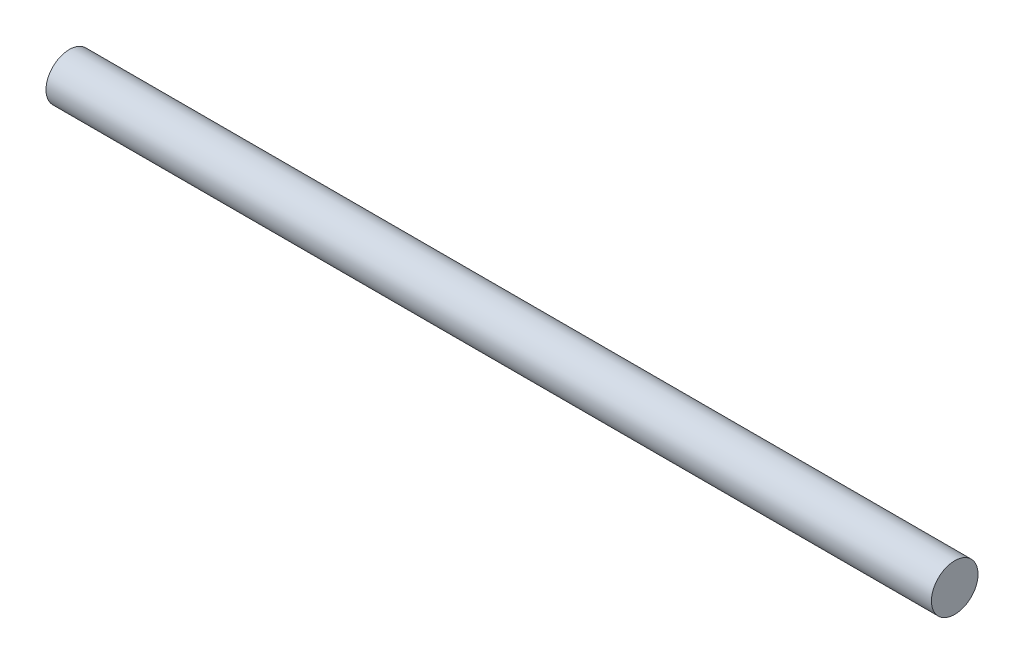
ISO-10303-21;
HEADER;
FILE_DESCRIPTION(('STEP AP214'),'2;1');
FILE_NAME('part.step','',(''),(''),'','','');
FILE_SCHEMA(('AUTOMOTIVE_DESIGN { 1 0 10303 214 1 1 1 1 }'));
ENDSEC;
DATA;
#1=APPLICATION_CONTEXT('core data for automotive mechanical design processes');
#2=APPLICATION_PROTOCOL_DEFINITION('international standard','automotive_design',2000,#1);
#3=PRODUCT_CONTEXT('',#1,'mechanical');
#4=PRODUCT('Part','Part','',(#3));
#5=PRODUCT_RELATED_PRODUCT_CATEGORY('part','',(#4));
#6=PRODUCT_DEFINITION_FORMATION('','',#4);
#7=PRODUCT_DEFINITION_CONTEXT('part definition',#1,'design');
#8=PRODUCT_DEFINITION('design','',#6,#7);
#9=PRODUCT_DEFINITION_SHAPE('','',#8);
#10=(LENGTH_UNIT() NAMED_UNIT(*) SI_UNIT(.MILLI.,.METRE.));
#11=(NAMED_UNIT(*) PLANE_ANGLE_UNIT() SI_UNIT($,.RADIAN.));
#12=(NAMED_UNIT(*) SI_UNIT($,.STERADIAN.) SOLID_ANGLE_UNIT());
#13=UNCERTAINTY_MEASURE_WITH_UNIT(LENGTH_MEASURE(1.E-05),#10,'distance_accuracy_value','');
#14=(GEOMETRIC_REPRESENTATION_CONTEXT(3) GLOBAL_UNCERTAINTY_ASSIGNED_CONTEXT((#13)) GLOBAL_UNIT_ASSIGNED_CONTEXT((#10,
#11,#12)) REPRESENTATION_CONTEXT('',''));
#15=CARTESIAN_POINT('',(0.,0.,0.));
#16=DIRECTION('',(0.,0.,1.));
#17=DIRECTION('',(1.,0.,0.));
#18=AXIS2_PLACEMENT_3D('',#15,#16,#17);
#19=CARTESIAN_POINT('',(-47.5,2.5,0.));
#20=DIRECTION('',(1.,0.,0.));
#21=DIRECTION('',(0.,0.,-1.));
#22=AXIS2_PLACEMENT_3D('',#19,#20,#21);
#23=PLANE('',#22);
#24=CARTESIAN_POINT('',(-47.5,0.,0.));
#25=DIRECTION('',(-1.,0.,0.));
#26=DIRECTION('',(0.,0.,1.));
#27=AXIS2_PLACEMENT_3D('',#24,#25,#26);
#28=CIRCLE('',#27,2.5);
#29=CARTESIAN_POINT('',(-47.5,0.,2.5));
#30=VERTEX_POINT('',#29);
#31=EDGE_CURVE('E10',#30,#30,#28,.T.);
#32=ORIENTED_EDGE('',*,*,#31,.T.);
#33=EDGE_LOOP('',(#32));
#34=FACE_BOUND('',#33,.T.);
#35=ADVANCED_FACE('F37',(#34),#23,.F.);
#36=CARTESIAN_POINT('',(-9.1355075639763,0.,0.));
#37=DIRECTION('',(-1.,0.,0.));
#38=DIRECTION('',(0.,0.,1.));
#39=AXIS2_PLACEMENT_3D('',#36,#37,#38);
#40=CYLINDRICAL_SURFACE('',#39,2.5);
#41=ORIENTED_EDGE('',*,*,#31,.F.);
#42=EDGE_LOOP('',(#41));
#43=FACE_BOUND('',#42,.T.);
#44=CARTESIAN_POINT('',(47.5,0.,0.));
#45=DIRECTION('',(-1.,0.,0.));
#46=DIRECTION('',(0.,0.,1.));
#47=AXIS2_PLACEMENT_3D('',#44,#45,#46);
#48=CIRCLE('',#47,2.5);
#49=CARTESIAN_POINT('',(47.5,0.,2.5));
#50=VERTEX_POINT('',#49);
#51=EDGE_CURVE('E44',#50,#50,#48,.T.);
#52=ORIENTED_EDGE('',*,*,#51,.T.);
#53=EDGE_LOOP('',(#52));
#54=FACE_BOUND('',#53,.T.);
#55=ADVANCED_FACE('F51',(#43,#54),#40,.T.);
#56=CARTESIAN_POINT('',(47.5,2.5,0.));
#57=DIRECTION('',(-1.,0.,0.));
#58=DIRECTION('',(0.,0.,1.));
#59=AXIS2_PLACEMENT_3D('',#56,#57,#58);
#60=PLANE('',#59);
#61=ORIENTED_EDGE('',*,*,#51,.F.);
#62=EDGE_LOOP('',(#61));
#63=FACE_BOUND('',#62,.T.);
#64=ADVANCED_FACE('F53',(#63),#60,.F.);
#65=CLOSED_SHELL('',(#35,#55,#64));
#66=MANIFOLD_SOLID_BREP('B2',#65);
#67=ADVANCED_BREP_SHAPE_REPRESENTATION('',(#18,#66),#14);
#68=SHAPE_DEFINITION_REPRESENTATION(#9,#67);
ENDSEC;
END-ISO-10303-21;
